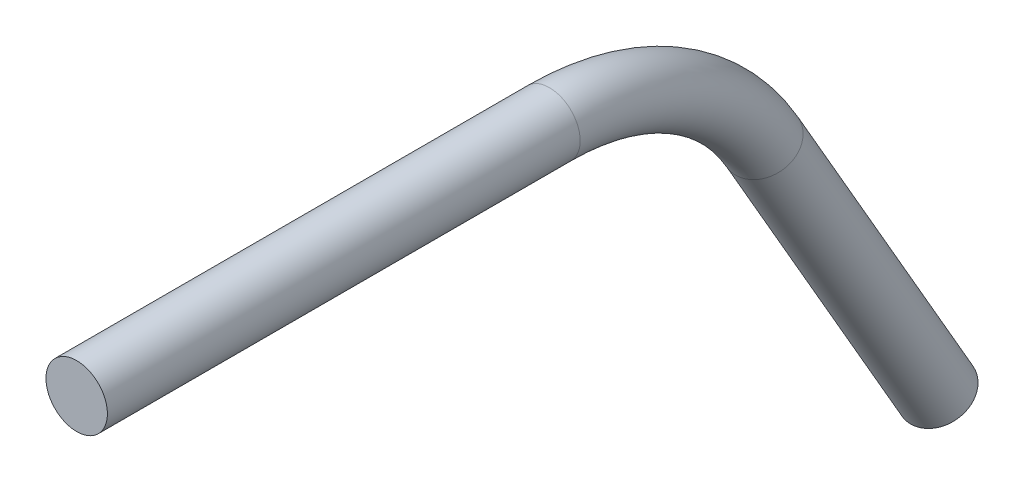
ISO-10303-21;
HEADER;
FILE_DESCRIPTION(('STEP AP214'),'2;1');
FILE_NAME('part.step','',(''),(''),'','','');
FILE_SCHEMA(('AUTOMOTIVE_DESIGN { 1 0 10303 214 1 1 1 1 }'));
ENDSEC;
DATA;
#1=APPLICATION_CONTEXT('core data for automotive mechanical design processes');
#2=APPLICATION_PROTOCOL_DEFINITION('international standard','automotive_design',2000,#1);
#3=PRODUCT_CONTEXT('',#1,'mechanical');
#4=PRODUCT('Part','Part','',(#3));
#5=PRODUCT_RELATED_PRODUCT_CATEGORY('part','',(#4));
#6=PRODUCT_DEFINITION_FORMATION('','',#4);
#7=PRODUCT_DEFINITION_CONTEXT('part definition',#1,'design');
#8=PRODUCT_DEFINITION('design','',#6,#7);
#9=PRODUCT_DEFINITION_SHAPE('','',#8);
#10=(LENGTH_UNIT() NAMED_UNIT(*) SI_UNIT(.MILLI.,.METRE.));
#11=(NAMED_UNIT(*) PLANE_ANGLE_UNIT() SI_UNIT($,.RADIAN.));
#12=(NAMED_UNIT(*) SI_UNIT($,.STERADIAN.) SOLID_ANGLE_UNIT());
#13=UNCERTAINTY_MEASURE_WITH_UNIT(LENGTH_MEASURE(1.E-05),#10,'distance_accuracy_value','');
#14=(GEOMETRIC_REPRESENTATION_CONTEXT(3) GLOBAL_UNCERTAINTY_ASSIGNED_CONTEXT((#13)) GLOBAL_UNIT_ASSIGNED_CONTEXT((#10,
#11,#12)) REPRESENTATION_CONTEXT('',''));
#15=CARTESIAN_POINT('',(0.,0.,0.));
#16=DIRECTION('',(0.,0.,1.));
#17=DIRECTION('',(1.,0.,0.));
#18=AXIS2_PLACEMENT_3D('',#15,#16,#17);
#19=CARTESIAN_POINT('',(0.,-12.7000000000001,-70.8323484187082));
#20=DIRECTION('',(0.,-0.86602540378444,-0.499999999999998));
#21=DIRECTION('',(0.,0.499999999999998,-0.86602540378444));
#22=AXIS2_PLACEMENT_3D('',#19,#20,#21);
#23=CYLINDRICAL_SURFACE('',#22,3.175);
#24=CARTESIAN_POINT('',(0.,-12.7000000000001,-70.8323484187082));
#25=DIRECTION('',(0.,0.86602540378444,0.499999999999998));
#26=DIRECTION('',(1.,0.,0.));
#27=AXIS2_PLACEMENT_3D('',#24,#25,#26);
#28=CIRCLE('',#27,3.175);
#29=CARTESIAN_POINT('',(0.,-11.1125000000001,-73.5819790757238));
#30=VERTEX_POINT('',#29);
#31=EDGE_CURVE('E37',#30,#30,#28,.T.);
#32=ORIENTED_EDGE('',*,*,#31,.F.);
#33=EDGE_LOOP('',(#32));
#34=FACE_BOUND('',#33,.T.);
#35=CARTESIAN_POINT('',(0.,-43.9940905122495,-88.8999999999999));
#36=DIRECTION('',(0.,0.86602540378444,0.499999999999998));
#37=DIRECTION('',(1.,0.,0.));
#38=AXIS2_PLACEMENT_3D('',#35,#36,#37);
#39=CIRCLE('',#38,3.175);
#40=CARTESIAN_POINT('',(3.175,-43.9940905122495,-88.8999999999999));
#41=VERTEX_POINT('',#40);
#42=EDGE_CURVE('E10',#41,#41,#39,.T.);
#43=ORIENTED_EDGE('',*,*,#42,.T.);
#44=EDGE_LOOP('',(#43));
#45=FACE_BOUND('',#44,.T.);
#46=ADVANCED_FACE('F31',(#34,#45),#23,.T.);
#47=CARTESIAN_POINT('',(0.,-25.4,-48.8353031625835));
#48=DIRECTION('',(-1.,0.,0.));
#49=DIRECTION('',(0.,0.,1.));
#50=AXIS2_PLACEMENT_3D('',#47,#48,#49);
#51=TOROIDAL_SURFACE('',#50,25.4,3.175);
#52=CARTESIAN_POINT('',(0.,0.,-48.8353031625835));
#53=DIRECTION('',(0.,0.,1.));
#54=DIRECTION('',(1.,0.,0.));
#55=AXIS2_PLACEMENT_3D('',#52,#53,#54);
#56=CIRCLE('',#55,3.175);
#57=CARTESIAN_POINT('',(0.,3.175,-48.8353031625835));
#58=VERTEX_POINT('',#57);
#59=EDGE_CURVE('E41',#58,#58,#56,.T.);
#60=CARTESIAN_POINT('',(0.,-25.4,-48.8353031625835));
#61=DIRECTION('',(-1.,0.,0.));
#62=DIRECTION('',(0.,0.,1.));
#63=AXIS2_PLACEMENT_3D('',#60,#61,#62);
#64=CIRCLE('',#63,28.575);
#65=EDGE_CURVE('',#58,#30,#64,.T.);
#66=ORIENTED_EDGE('',*,*,#59,.F.);
#67=ORIENTED_EDGE('',*,*,#31,.T.);
#68=ORIENTED_EDGE('',*,*,#65,.T.);
#69=ORIENTED_EDGE('',*,*,#65,.F.);
#70=EDGE_LOOP('',(#66,#68,#67,#69));
#71=FACE_BOUND('',#70,.T.);
#72=ADVANCED_FACE('F56',(#71),#51,.T.);
#73=CARTESIAN_POINT('',(0.,0.,-48.8353031625835));
#74=DIRECTION('',(0.,0.,1.));
#75=DIRECTION('',(1.,0.,0.));
#76=AXIS2_PLACEMENT_3D('',#73,#74,#75);
#77=CYLINDRICAL_SURFACE('',#76,3.175);
#78=ORIENTED_EDGE('',*,*,#59,.T.);
#79=EDGE_LOOP('',(#78));
#80=FACE_BOUND('',#79,.T.);
#81=CARTESIAN_POINT('',(0.,0.,0.));
#82=DIRECTION('',(0.,0.,1.));
#83=DIRECTION('',(1.,0.,0.));
#84=AXIS2_PLACEMENT_3D('',#81,#82,#83);
#85=CIRCLE('',#84,3.175);
#86=CARTESIAN_POINT('',(3.175,0.,0.));
#87=VERTEX_POINT('',#86);
#88=EDGE_CURVE('E45',#87,#87,#85,.T.);
#89=ORIENTED_EDGE('',*,*,#88,.F.);
#90=EDGE_LOOP('',(#89));
#91=FACE_BOUND('',#90,.T.);
#92=ADVANCED_FACE('F53',(#80,#91),#77,.T.);
#93=CARTESIAN_POINT('',(0.,-43.9940905122495,-88.8999999999999));
#94=DIRECTION('',(0.,0.86602540378444,0.499999999999998));
#95=DIRECTION('',(1.,0.,0.));
#96=AXIS2_PLACEMENT_3D('',#93,#94,#95);
#97=PLANE('',#96);
#98=ORIENTED_EDGE('',*,*,#42,.F.);
#99=EDGE_LOOP('',(#98));
#100=FACE_BOUND('',#99,.T.);
#101=ADVANCED_FACE('F55',(#100),#97,.F.);
#102=CARTESIAN_POINT('',(0.,0.,0.));
#103=DIRECTION('',(0.,0.,1.));
#104=DIRECTION('',(1.,0.,0.));
#105=AXIS2_PLACEMENT_3D('',#102,#103,#104);
#106=PLANE('',#105);
#107=ORIENTED_EDGE('',*,*,#88,.T.);
#108=EDGE_LOOP('',(#107));
#109=FACE_BOUND('',#108,.T.);
#110=ADVANCED_FACE('F51',(#109),#106,.T.);
#111=CLOSED_SHELL('',(#46,#72,#92,#101,#110));
#112=MANIFOLD_SOLID_BREP('B2',#111);
#113=ADVANCED_BREP_SHAPE_REPRESENTATION('',(#18,#112),#14);
#114=SHAPE_DEFINITION_REPRESENTATION(#9,#113);
ENDSEC;
END-ISO-10303-21;
